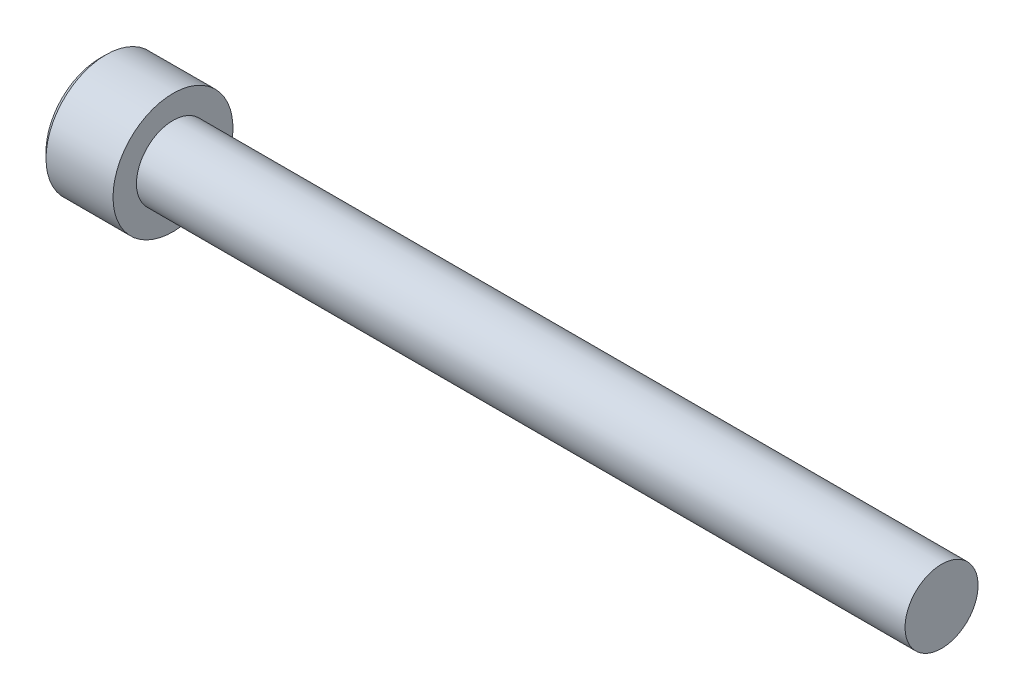
ISO-10303-21;
HEADER;
FILE_DESCRIPTION(('STEP AP214'),'2;1');
FILE_NAME('part.step','',(''),(''),'','','');
FILE_SCHEMA(('AUTOMOTIVE_DESIGN { 1 0 10303 214 1 1 1 1 }'));
ENDSEC;
DATA;
#1=APPLICATION_CONTEXT('core data for automotive mechanical design processes');
#2=APPLICATION_PROTOCOL_DEFINITION('international standard','automotive_design',2000,#1);
#3=PRODUCT_CONTEXT('',#1,'mechanical');
#4=PRODUCT('Part','Part','',(#3));
#5=PRODUCT_RELATED_PRODUCT_CATEGORY('part','',(#4));
#6=PRODUCT_DEFINITION_FORMATION('','',#4);
#7=PRODUCT_DEFINITION_CONTEXT('part definition',#1,'design');
#8=PRODUCT_DEFINITION('design','',#6,#7);
#9=PRODUCT_DEFINITION_SHAPE('','',#8);
#10=(LENGTH_UNIT() NAMED_UNIT(*) SI_UNIT(.MILLI.,.METRE.));
#11=(NAMED_UNIT(*) PLANE_ANGLE_UNIT() SI_UNIT($,.RADIAN.));
#12=(NAMED_UNIT(*) SI_UNIT($,.STERADIAN.) SOLID_ANGLE_UNIT());
#13=UNCERTAINTY_MEASURE_WITH_UNIT(LENGTH_MEASURE(1.E-05),#10,'distance_accuracy_value','');
#14=(GEOMETRIC_REPRESENTATION_CONTEXT(3) GLOBAL_UNCERTAINTY_ASSIGNED_CONTEXT((#13)) GLOBAL_UNIT_ASSIGNED_CONTEXT((#10,
#11,#12)) REPRESENTATION_CONTEXT('',''));
#15=CARTESIAN_POINT('',(0.,0.,0.));
#16=DIRECTION('',(0.,0.,1.));
#17=DIRECTION('',(1.,0.,0.));
#18=AXIS2_PLACEMENT_3D('',#15,#16,#17);
#19=CARTESIAN_POINT('',(-2.28600000000007,0.,0.));
#20=DIRECTION('',(-1.,0.,0.));
#21=DIRECTION('',(0.,0.,1.));
#22=AXIS2_PLACEMENT_3D('',#19,#20,#21);
#23=PLANE('',#22);
#24=DIRECTION('',(0.,0.5,0.866025403784439));
#25=VECTOR('',#24,1.);
#26=CARTESIAN_POINT('',(-2.28600000000007,2.29135888084633,0.));
#27=LINE('',#26,#25);
#28=CARTESIAN_POINT('',(-2.28600000000007,2.29135888084633,0.));
#29=VERTEX_POINT('',#28);
#30=CARTESIAN_POINT('',(-2.28600000000007,1.14567944042316,-1.984375));
#31=VERTEX_POINT('',#30);
#32=EDGE_CURVE('E72',#29,#31,#27,.F.);
#33=ORIENTED_EDGE('',*,*,#32,.T.);
#34=DIRECTION('',(0.,1.,0.));
#35=VECTOR('',#34,1.);
#36=CARTESIAN_POINT('',(-2.28600000000007,1.14567944042316,-1.984375));
#37=LINE('',#36,#35);
#38=CARTESIAN_POINT('',(-2.28600000000007,-1.14567944042316,-1.984375));
#39=VERTEX_POINT('',#38);
#40=EDGE_CURVE('E67',#31,#39,#37,.F.);
#41=ORIENTED_EDGE('',*,*,#40,.T.);
#42=DIRECTION('',(0.,0.5,-0.866025403784439));
#43=VECTOR('',#42,1.);
#44=CARTESIAN_POINT('',(-2.28600000000007,-1.14567944042316,-1.984375));
#45=LINE('',#44,#43);
#46=CARTESIAN_POINT('',(-2.28600000000007,-2.29135888084633,0.));
#47=VERTEX_POINT('',#46);
#48=EDGE_CURVE('E81',#39,#47,#45,.F.);
#49=ORIENTED_EDGE('',*,*,#48,.T.);
#50=DIRECTION('',(0.,-0.5,-0.866025403784439));
#51=VECTOR('',#50,1.);
#52=CARTESIAN_POINT('',(-2.28600000000007,-2.29135888084633,0.));
#53=LINE('',#52,#51);
#54=CARTESIAN_POINT('',(-2.28600000000007,-1.14567944042317,1.984375));
#55=VERTEX_POINT('',#54);
#56=EDGE_CURVE('E84',#47,#55,#53,.F.);
#57=ORIENTED_EDGE('',*,*,#56,.T.);
#58=DIRECTION('',(0.,1.,0.));
#59=VECTOR('',#58,1.);
#60=CARTESIAN_POINT('',(-2.28600000000007,-1.14567944042317,1.984375));
#61=LINE('',#60,#59);
#62=CARTESIAN_POINT('',(-2.28600000000007,1.14567944042317,1.984375));
#63=VERTEX_POINT('',#62);
#64=EDGE_CURVE('E94',#55,#63,#61,.T.);
#65=ORIENTED_EDGE('',*,*,#64,.T.);
#66=DIRECTION('',(0.,-0.5,0.866025403784439));
#67=VECTOR('',#66,1.);
#68=CARTESIAN_POINT('',(-2.28600000000007,1.14567944042316,1.984375));
#69=LINE('',#68,#67);
#70=EDGE_CURVE('E265',#63,#29,#69,.F.);
#71=ORIENTED_EDGE('',*,*,#70,.T.);
#72=EDGE_LOOP('',(#33,#41,#49,#57,#65,#71));
#73=FACE_BOUND('',#72,.T.);
#74=ADVANCED_FACE('F18',(#73),#23,.T.);
#75=CARTESIAN_POINT('',(-2.28600000000007,-1.14567944042316,-1.984375));
#76=DIRECTION('',(0.,-0.866025403784439,-0.5));
#77=DIRECTION('',(0.,0.5,-0.866025403784439));
#78=AXIS2_PLACEMENT_3D('',#75,#76,#77);
#79=PLANE('',#78);
#80=CARTESIAN_POINT('',(-4.82599999995871,-1.14567944040756,-1.98437500001887));
#81=CARTESIAN_POINT('',(-4.78666022792997,-1.18505700230148,-1.91617106214563));
#82=CARTESIAN_POINT('',(-4.74963132844072,-1.22509295783734,-1.8468267530301));
#83=CARTESIAN_POINT('',(-4.68183299424977,-1.30673037975396,-1.70542659047317));
#84=CARTESIAN_POINT('',(-4.65110127019237,-1.34833960561553,-1.63335729721673));
#85=CARTESIAN_POINT('',(-4.59845762010516,-1.432242568594,-1.48803310243203));
#86=CARTESIAN_POINT('',(-4.57641341195893,-1.47451494967301,-1.41481519064643));
#87=CARTESIAN_POINT('',(-4.54245011067441,-1.55999007976842,-1.26676792253773));
#88=CARTESIAN_POINT('',(-4.53050567471972,-1.6031902195197,-1.19194308559438));
#89=CARTESIAN_POINT('',(-4.51972842752365,-1.67764765054852,-1.06297903205139));
#90=CARTESIAN_POINT('',(-4.51813352794834,-1.70880881707173,-1.00900630841009));
#91=CARTESIAN_POINT('',(-4.52082392138599,-1.77108016542046,-0.901149169214274));
#92=CARTESIAN_POINT('',(-4.52511127545884,-1.80219032554946,-0.847264791239237));
#93=CARTESIAN_POINT('',(-4.53932219421538,-1.86411684097343,-0.740004920189235));
#94=CARTESIAN_POINT('',(-4.54925206045723,-1.8949328285454,-0.686630064029166));
#95=CARTESIAN_POINT('',(-4.5742029484467,-1.95603190279815,-0.580803363127978));
#96=CARTESIAN_POINT('',(-4.58922357974385,-1.98631503016081,-0.528351447923769));
#97=CARTESIAN_POINT('',(-4.63380478900425,-2.06386502548479,-0.394030915895904));
#98=CARTESIAN_POINT('',(-4.66672213384104,-2.11065153226583,-0.312994309042484));
#99=CARTESIAN_POINT('',(-4.72228952038986,-2.17944749410732,-0.193836207777459));
#100=CARTESIAN_POINT('',(-4.74181309375939,-2.20211890802843,-0.154568166986659));
#101=CARTESIAN_POINT('',(-4.78263970065987,-2.24704195201531,-0.0767591723707469));
#102=CARTESIAN_POINT('',(-4.80394164363173,-2.2692938292399,-0.0382177904539708));
#103=CARTESIAN_POINT('',(-4.82599999995675,-2.29135888085868,2.13931096265935E-11));
#104=B_SPLINE_CURVE_WITH_KNOTS('',3,(#80,#81,#82,#83,#84,#85,#86,#87,#88,#89,#90,#91,#92,#93,
#94,#95,#96,#97,#98,#99,#100,#101,#102,#103),.UNSPECIFIED.,.F.,.F.,(4,2,2,2,2,2,2,2,2,2,2,4),
(0.,0.264284909626495,0.530108996358094,0.791712695414128,1.05265800174404,1.23942150116703,
1.42625045663858,1.61328847394198,1.80031214908683,2.09727151182814,2.24534838946042,
2.39333511890876),.UNSPECIFIED.);
#105=CARTESIAN_POINT('',(-4.8259999999622,-1.14567944043207,-1.98437500001542));
#106=VERTEX_POINT('',#105);
#107=CARTESIAN_POINT('',(-4.82599999996846,-2.2913588808704,-2.00043543490866E-11));
#108=VERTEX_POINT('',#107);
#109=EDGE_CURVE('E21',#106,#108,#104,.T.);
#110=ORIENTED_EDGE('',*,*,#109,.T.);
#111=DIRECTION('',(1.,0.,0.));
#112=VECTOR('',#111,1.);
#113=CARTESIAN_POINT('',(-2.28600000000007,-2.29135888084633,0.));
#114=LINE('',#113,#112);
#115=EDGE_CURVE('E88',#108,#47,#114,.T.);
#116=ORIENTED_EDGE('',*,*,#115,.T.);
#117=ORIENTED_EDGE('',*,*,#48,.F.);
#118=DIRECTION('',(-1.,0.,0.));
#119=VECTOR('',#118,1.);
#120=CARTESIAN_POINT('',(-2.28600000000007,-1.14567944042316,-1.984375));
#121=LINE('',#120,#119);
#122=EDGE_CURVE('E59',#39,#106,#121,.T.);
#123=ORIENTED_EDGE('',*,*,#122,.T.);
#124=EDGE_LOOP('',(#110,#116,#117,#123));
#125=FACE_BOUND('',#124,.T.);
#126=ADVANCED_FACE('F89',(#125),#79,.F.);
#127=CARTESIAN_POINT('',(-2.28600000000007,-2.29135888084633,0.));
#128=DIRECTION('',(0.,-0.866025403784439,0.5));
#129=DIRECTION('',(0.,-0.5,-0.866025403784439));
#130=AXIS2_PLACEMENT_3D('',#127,#128,#129);
#131=PLANE('',#130);
#132=CARTESIAN_POINT('',(-4.8259999999587,-2.29135888085486,-2.29477011545215E-11));
#133=CARTESIAN_POINT('',(-4.78666022792997,-2.25198131896546,0.0682039378529055));
#134=CARTESIAN_POINT('',(-4.74963132844072,-2.21194536343147,0.137548246969503));
#135=CARTESIAN_POINT('',(-4.68183299424977,-2.13030794151622,0.278948409527231));
#136=CARTESIAN_POINT('',(-4.65110127019237,-2.08869871565414,0.351017702783381));
#137=CARTESIAN_POINT('',(-4.59845762010516,-2.00479575267531,0.49634189756787));
#138=CARTESIAN_POINT('',(-4.57641341195893,-1.96252337159644,0.569559809353542));
#139=CARTESIAN_POINT('',(-4.5424501106744,-1.87704824150112,0.717607077462301));
#140=CARTESIAN_POINT('',(-4.53050567471972,-1.8338481017498,0.792431914405622));
#141=CARTESIAN_POINT('',(-4.51972842752365,-1.75939067072096,0.921395967948603));
#142=CARTESIAN_POINT('',(-4.51813352794834,-1.72822950419776,0.975368691589913));
#143=CARTESIAN_POINT('',(-4.52082392138599,-1.66595815584903,1.08322583078573));
#144=CARTESIAN_POINT('',(-4.52511127545884,-1.63484799572003,1.13711020876076));
#145=CARTESIAN_POINT('',(-4.53932219421538,-1.57292148029607,1.24437007981077));
#146=CARTESIAN_POINT('',(-4.54925206045723,-1.54210549272409,1.29774493597083));
#147=CARTESIAN_POINT('',(-4.5742029484467,-1.48100641847134,1.40357163687202));
#148=CARTESIAN_POINT('',(-4.58922357974385,-1.45072329110868,1.45602355207623));
#149=CARTESIAN_POINT('',(-4.63380478900425,-1.3731732957847,1.5903440841041));
#150=CARTESIAN_POINT('',(-4.66672213384104,-1.32638678900366,1.67138069095752));
#151=CARTESIAN_POINT('',(-4.72228952038986,-1.25759082716218,1.79053879222254));
#152=CARTESIAN_POINT('',(-4.74181309375939,-1.23491941324106,1.82980683301334));
#153=CARTESIAN_POINT('',(-4.78263970065987,-1.18999636925419,1.90761582762925));
#154=CARTESIAN_POINT('',(-4.80394164363173,-1.1677444920296,1.94615720954603));
#155=CARTESIAN_POINT('',(-4.82599999995675,-1.14567944041081,1.98437500002139));
#156=B_SPLINE_CURVE_WITH_KNOTS('',3,(#132,#133,#134,#135,#136,#137,#138,#139,#140,#141,#142,
#143,#144,#145,#146,#147,#148,#149,#150,#151,#152,#153,#154,#155),.UNSPECIFIED.,.F.,.F.,(4,2,2,
2,2,2,2,2,2,2,2,4),(0.,0.264284909626495,0.530108996358093,0.791712695414127,1.05265800174404,
1.23942150116703,1.42625045663858,1.61328847394198,1.80031214908683,2.09727151182814,
2.24534838946042,2.39333511890876),.UNSPECIFIED.);
#157=CARTESIAN_POINT('',(-4.82599999996846,-1.14567944045252,1.98437500001084));
#158=VERTEX_POINT('',#157);
#159=EDGE_CURVE('E193',#108,#158,#156,.T.);
#160=ORIENTED_EDGE('',*,*,#159,.T.);
#161=DIRECTION('',(1.,0.,0.));
#162=VECTOR('',#161,1.);
#163=CARTESIAN_POINT('',(-2.28600000000007,-1.14567944042317,1.984375));
#164=LINE('',#163,#162);
#165=EDGE_CURVE('E98',#158,#55,#164,.T.);
#166=ORIENTED_EDGE('',*,*,#165,.T.);
#167=ORIENTED_EDGE('',*,*,#56,.F.);
#168=ORIENTED_EDGE('',*,*,#115,.F.);
#169=EDGE_LOOP('',(#160,#166,#167,#168));
#170=FACE_BOUND('',#169,.T.);
#171=ADVANCED_FACE('F96',(#170),#131,.F.);
#172=CARTESIAN_POINT('',(-2.28600000000007,-1.14567944042317,1.984375));
#173=DIRECTION('',(0.,0.,1.));
#174=DIRECTION('',(1.,0.,0.));
#175=AXIS2_PLACEMENT_3D('',#172,#173,#174);
#176=PLANE('',#175);
#177=ORIENTED_EDGE('',*,*,#165,.F.);
#178=CARTESIAN_POINT('',(-4.8259999999587,-1.14567944044731,1.98437499999592));
#179=CARTESIAN_POINT('',(-4.78691618362759,-1.06743880343337,1.98437499999852));
#180=CARTESIAN_POINT('',(-4.7501144768492,-0.987898318961585,1.9843749999996));
#181=CARTESIAN_POINT('',(-4.68265620500543,-0.825677042029378,1.9843750000004));
#182=CARTESIAN_POINT('',(-4.65204056061158,-0.742979382529768,1.98437500000011));
#183=CARTESIAN_POINT('',(-4.59917392283072,-0.575193959556404,1.98437499999988));
#184=CARTESIAN_POINT('',(-4.57689462080734,-0.49011535911761,1.98437499999994));
#185=CARTESIAN_POINT('',(-4.54259467221838,-0.318093091130319,1.98437500000006));
#186=CARTESIAN_POINT('',(-4.53054230228845,-0.231156054976752,1.98437500000012));
#187=CARTESIAN_POINT('',(-4.52249110263748,-0.119918521510987,1.98437499999997));
#188=CARTESIAN_POINT('',(-4.5211894755748,-0.095946844304627,1.98437499999992));
#189=CARTESIAN_POINT('',(-4.51945182629809,-0.0479845644411721,1.98437500000008));
#190=CARTESIAN_POINT('',(-4.51901533386212,-0.0239939791589256,1.98437500000028));
#191=CARTESIAN_POINT('',(-4.51901809008374,0.0602201717457216,1.98437500000061));
#192=CARTESIAN_POINT('',(-4.52177452299895,0.120461721905418,1.98437500000017));
#193=CARTESIAN_POINT('',(-4.53263655124937,0.240474970989155,1.98437499999983));
#194=CARTESIAN_POINT('',(-4.5407458774972,0.300246312758386,1.98437499999994));
#195=CARTESIAN_POINT('',(-4.57259622946933,0.478763752804253,1.98437500000012));
#196=CARTESIAN_POINT('',(-4.60385422611701,0.596208828937716,1.98437500000003));
#197=CARTESIAN_POINT('',(-4.66780003592242,0.785921487441385,1.98437499999998));
#198=CARTESIAN_POINT('',(-4.69623457768568,0.859734609867161,1.98437499999999));
#199=CARTESIAN_POINT('',(-4.75786140400834,1.00456595519332,1.98437500000001));
#200=CARTESIAN_POINT('',(-4.79100779300387,1.07560356657162,1.98437500000002));
#201=CARTESIAN_POINT('',(-4.82599999995679,1.14567944044795,1.984375));
#202=B_SPLINE_CURVE_WITH_KNOTS('',3,(#178,#179,#180,#181,#182,#183,#184,#185,#186,#187,#188,
#189,#190,#191,#192,#193,#194,#195,#196,#197,#198,#199,#200,#201),.UNSPECIFIED.,.F.,.F.,(4,2,2,
2,2,2,2,2,2,2,2,4),(0.,0.262559005207489,0.526801735838257,0.790138824405868,1.05265603861851,
1.12466619182165,1.19663719499109,1.37727026726594,1.55802937209457,1.92104085090406,
2.15819130092386,2.39317265078733),.UNSPECIFIED.);
#203=CARTESIAN_POINT('',(-4.82599999996846,1.14567944041787,1.98437500003084));
#204=VERTEX_POINT('',#203);
#205=EDGE_CURVE('E174',#158,#204,#202,.T.);
#206=ORIENTED_EDGE('',*,*,#205,.T.);
#207=DIRECTION('',(1.,0.,0.));
#208=VECTOR('',#207,1.);
#209=CARTESIAN_POINT('',(-2.28600000000007,1.14567944042316,1.984375));
#210=LINE('',#209,#208);
#211=EDGE_CURVE('E262',#204,#63,#210,.T.);
#212=ORIENTED_EDGE('',*,*,#211,.T.);
#213=ORIENTED_EDGE('',*,*,#64,.F.);
#214=EDGE_LOOP('',(#177,#206,#212,#213));
#215=FACE_BOUND('',#214,.T.);
#216=ADVANCED_FACE('F183',(#215),#176,.F.);
#217=CARTESIAN_POINT('',(-2.28600000000007,1.14567944042316,1.984375));
#218=DIRECTION('',(0.,0.866025403784439,0.5));
#219=DIRECTION('',(0.,-0.5,0.866025403784439));
#220=AXIS2_PLACEMENT_3D('',#217,#218,#219);
#221=PLANE('',#220);
#222=CARTESIAN_POINT('',(-4.8259999999587,1.14567944040756,1.98437500001887));
#223=CARTESIAN_POINT('',(-4.78666022792997,1.18505700230148,1.91617106214563));
#224=CARTESIAN_POINT('',(-4.74963132844072,1.22509295783734,1.8468267530301));
#225=CARTESIAN_POINT('',(-4.68183299424977,1.30673037975396,1.70542659047317));
#226=CARTESIAN_POINT('',(-4.65110127019237,1.34833960561553,1.63335729721672));
#227=CARTESIAN_POINT('',(-4.59845762010516,1.432242568594,1.48803310243203));
#228=CARTESIAN_POINT('',(-4.57641341195893,1.47451494967301,1.41481519064643));
#229=CARTESIAN_POINT('',(-4.5424501106744,1.55999007976842,1.26676792253773));
#230=CARTESIAN_POINT('',(-4.53050567471972,1.6031902195197,1.19194308559439));
#231=CARTESIAN_POINT('',(-4.51972842752365,1.67764765054852,1.06297903205139));
#232=CARTESIAN_POINT('',(-4.51813352794834,1.70880881707173,1.00900630841009));
#233=CARTESIAN_POINT('',(-4.52082392138599,1.77108016542046,0.901149169214275));
#234=CARTESIAN_POINT('',(-4.52511127545884,1.80219032554946,0.847264791239238));
#235=CARTESIAN_POINT('',(-4.53932219421538,1.86411684097342,0.740004920189235));
#236=CARTESIAN_POINT('',(-4.54925206045723,1.8949328285454,0.686630064029167));
#237=CARTESIAN_POINT('',(-4.5742029484467,1.95603190279815,0.580803363127978));
#238=CARTESIAN_POINT('',(-4.58922357974385,1.98631503016081,0.52835144792377));
#239=CARTESIAN_POINT('',(-4.63380478900425,2.06386502548479,0.394030915895905));
#240=CARTESIAN_POINT('',(-4.66672213384104,2.11065153226583,0.312994309042484));
#241=CARTESIAN_POINT('',(-4.72228952038986,2.17944749410732,0.19383620777746));
#242=CARTESIAN_POINT('',(-4.74181309375939,2.20211890802843,0.154568166986659));
#243=CARTESIAN_POINT('',(-4.78263970065987,2.2470419520153,0.0767591723707469));
#244=CARTESIAN_POINT('',(-4.80394164363173,2.2692938292399,0.0382177904539711));
#245=CARTESIAN_POINT('',(-4.82599999995675,2.29135888085868,-2.13927120621134E-11));
#246=B_SPLINE_CURVE_WITH_KNOTS('',3,(#222,#223,#224,#225,#226,#227,#228,#229,#230,#231,#232,
#233,#234,#235,#236,#237,#238,#239,#240,#241,#242,#243,#244,#245),.UNSPECIFIED.,.F.,.F.,(4,2,2,
2,2,2,2,2,2,2,2,4),(0.,0.264284909626494,0.530108996358092,0.791712695414125,1.05265800174404,
1.23942150116703,1.42625045663858,1.61328847394198,1.80031214908683,2.09727151182813,
2.24534838946042,2.39333511890876),.UNSPECIFIED.);
#247=CARTESIAN_POINT('',(-4.82599999996846,2.29135888087039,2.00042200943634E-11));
#248=VERTEX_POINT('',#247);
#249=EDGE_CURVE('E168',#204,#248,#246,.T.);
#250=ORIENTED_EDGE('',*,*,#249,.T.);
#251=DIRECTION('',(1.,0.,0.));
#252=VECTOR('',#251,1.);
#253=CARTESIAN_POINT('',(-2.28600000000007,2.29135888084633,0.));
#254=LINE('',#253,#252);
#255=EDGE_CURVE('E257',#248,#29,#254,.T.);
#256=ORIENTED_EDGE('',*,*,#255,.T.);
#257=ORIENTED_EDGE('',*,*,#70,.F.);
#258=ORIENTED_EDGE('',*,*,#211,.F.);
#259=EDGE_LOOP('',(#250,#256,#257,#258));
#260=FACE_BOUND('',#259,.T.);
#261=ADVANCED_FACE('F179',(#260),#221,.F.);
#262=CARTESIAN_POINT('',(-2.28600000000007,2.29135888084633,0.));
#263=DIRECTION('',(0.,0.866025403784439,-0.5));
#264=DIRECTION('',(0.,0.5,0.866025403784439));
#265=AXIS2_PLACEMENT_3D('',#262,#263,#264);
#266=PLANE('',#265);
#267=CARTESIAN_POINT('',(-4.82599999995871,2.29135888085486,2.29489280696874E-11));
#268=CARTESIAN_POINT('',(-4.78666022792997,2.25198131896547,-0.0682039378529039));
#269=CARTESIAN_POINT('',(-4.74963132844072,2.21194536343147,-0.137548246969502));
#270=CARTESIAN_POINT('',(-4.68183299424977,2.13030794151622,-0.278948409527229));
#271=CARTESIAN_POINT('',(-4.65110127019237,2.08869871565414,-0.351017702783379));
#272=CARTESIAN_POINT('',(-4.59845762010516,2.00479575267531,-0.496341897567869));
#273=CARTESIAN_POINT('',(-4.57641341195893,1.96252337159644,-0.569559809353541));
#274=CARTESIAN_POINT('',(-4.5424501106744,1.87704824150112,-0.7176070774623));
#275=CARTESIAN_POINT('',(-4.53050567471972,1.8338481017498,-0.792431914405622));
#276=CARTESIAN_POINT('',(-4.51972842752365,1.75939067072096,-0.921395967948603));
#277=CARTESIAN_POINT('',(-4.51813352794834,1.72822950419776,-0.975368691589912));
#278=CARTESIAN_POINT('',(-4.52082392138599,1.66595815584903,-1.08322583078573));
#279=CARTESIAN_POINT('',(-4.52511127545884,1.63484799572003,-1.13711020876076));
#280=CARTESIAN_POINT('',(-4.53932219421538,1.57292148029607,-1.24437007981077));
#281=CARTESIAN_POINT('',(-4.54925206045723,1.54210549272409,-1.29774493597083));
#282=CARTESIAN_POINT('',(-4.5742029484467,1.48100641847134,-1.40357163687202));
#283=CARTESIAN_POINT('',(-4.58922357974385,1.45072329110868,-1.45602355207623));
#284=CARTESIAN_POINT('',(-4.63380478900425,1.3731732957847,-1.5903440841041));
#285=CARTESIAN_POINT('',(-4.66672213384104,1.32638678900366,-1.67138069095752));
#286=CARTESIAN_POINT('',(-4.72228952038986,1.25759082716218,-1.79053879222254));
#287=CARTESIAN_POINT('',(-4.74181309375939,1.23491941324106,-1.82980683301334));
#288=CARTESIAN_POINT('',(-4.78263970065987,1.18999636925419,-1.90761582762925));
#289=CARTESIAN_POINT('',(-4.80394164363173,1.1677444920296,-1.94615720954603));
#290=CARTESIAN_POINT('',(-4.82599999995675,1.14567944041081,-1.98437500002139));
#291=B_SPLINE_CURVE_WITH_KNOTS('',3,(#267,#268,#269,#270,#271,#272,#273,#274,#275,#276,#277,
#278,#279,#280,#281,#282,#283,#284,#285,#286,#287,#288,#289,#290),.UNSPECIFIED.,.F.,.F.,(4,2,2,
2,2,2,2,2,2,2,2,4),(0.,0.264284909626495,0.530108996358093,0.791712695414127,1.05265800174404,
1.23942150116703,1.42625045663858,1.61328847394198,1.80031214908683,2.09727151182814,
2.24534838946042,2.39333511890876),.UNSPECIFIED.);
#292=CARTESIAN_POINT('',(-4.82599999996846,1.14567944045252,-1.98437500001084));
#293=VERTEX_POINT('',#292);
#294=EDGE_CURVE('E40',#248,#293,#291,.T.);
#295=ORIENTED_EDGE('',*,*,#294,.T.);
#296=DIRECTION('',(-1.,0.,0.));
#297=VECTOR('',#296,1.);
#298=CARTESIAN_POINT('',(-2.28600000000007,1.14567944042316,-1.984375));
#299=LINE('',#298,#297);
#300=EDGE_CURVE('E247',#293,#31,#299,.F.);
#301=ORIENTED_EDGE('',*,*,#300,.T.);
#302=ORIENTED_EDGE('',*,*,#32,.F.);
#303=ORIENTED_EDGE('',*,*,#255,.F.);
#304=EDGE_LOOP('',(#295,#301,#302,#303));
#305=FACE_BOUND('',#304,.T.);
#306=ADVANCED_FACE('F182',(#305),#266,.F.);
#307=CARTESIAN_POINT('',(-2.28600000000007,1.14567944042316,-1.984375));
#308=DIRECTION('',(0.,0.,-1.));
#309=DIRECTION('',(-1.,0.,0.));
#310=AXIS2_PLACEMENT_3D('',#307,#308,#309);
#311=PLANE('',#310);
#312=CARTESIAN_POINT('',(-4.8259999999587,1.14567944044731,-1.98437499999592));
#313=CARTESIAN_POINT('',(-4.78666022793094,1.06692431665146,-1.98437499999853));
#314=CARTESIAN_POINT('',(-4.74963132844318,0.986852405569011,-1.98437499999961));
#315=CARTESIAN_POINT('',(-4.6818329942566,0.823577561711963,-1.9843750000004));
#316=CARTESIAN_POINT('',(-4.65110127020207,0.740359109975722,-1.98437500000011));
#317=CARTESIAN_POINT('',(-4.59845762012233,0.572553183993917,-1.9843749999999));
#318=CARTESIAN_POINT('',(-4.57641341198063,0.488008421824127,-1.98437499999997));
#319=CARTESIAN_POINT('',(-4.54245011070673,0.317058161610178,-1.98437500000003));
#320=CARTESIAN_POINT('',(-4.53050567475816,0.230657882096267,-1.98437500000001));
#321=CARTESIAN_POINT('',(-4.51972842757294,0.0817430200124032,-1.984375));
#322=CARTESIAN_POINT('',(-4.51813352800283,0.0194206869508218,-1.984375));
#323=CARTESIAN_POINT('',(-4.52082392145254,-0.1051220097764,-1.984375));
#324=CARTESIAN_POINT('',(-4.52511127553227,-0.167342330049008,-1.984375));
#325=CARTESIAN_POINT('',(-4.53932219430377,-0.291195360925477,-1.984375));
#326=CARTESIAN_POINT('',(-4.54925206055372,-0.352827336083362,-1.984375));
#327=CARTESIAN_POINT('',(-4.57420294856008,-0.475025484616114,-1.984375));
#328=CARTESIAN_POINT('',(-4.58922357986604,-0.535591739354747,-1.984375));
#329=CARTESIAN_POINT('',(-4.63380478912724,-0.690691729958653,-1.984375));
#330=CARTESIAN_POINT('',(-4.66672213394715,-0.784264743465576,-1.984375));
#331=CARTESIAN_POINT('',(-4.7222895204619,-0.921856667069616,-1.984375));
#332=CARTESIAN_POINT('',(-4.74181309381856,-0.967199494886089,-1.984375));
#333=CARTESIAN_POINT('',(-4.78263970069104,-1.05704558280959,-1.984375));
#334=CARTESIAN_POINT('',(-4.80394164364776,-1.10154933723428,-1.984375));
#335=CARTESIAN_POINT('',(-4.82599999995675,-1.14567944044787,-1.984375));
#336=B_SPLINE_CURVE_WITH_KNOTS('',3,(#312,#313,#314,#315,#316,#317,#318,#319,#320,#321,#322,
#323,#324,#325,#326,#327,#328,#329,#330,#331,#332,#333,#334,#335),.UNSPECIFIED.,.F.,.F.,(4,2,2,
2,2,2,2,2,2,2,2,4),(0.,0.264284909658836,0.530108996422784,0.791712695509868,1.0526580018708,
1.23942150133878,1.42625045685537,1.61328847420389,1.80031214939384,2.09727151196384,
2.24534838950992,2.39333511887245),.UNSPECIFIED.);
#337=EDGE_CURVE('E133',#293,#106,#336,.T.);
#338=ORIENTED_EDGE('',*,*,#337,.T.);
#339=ORIENTED_EDGE('',*,*,#122,.F.);
#340=ORIENTED_EDGE('',*,*,#40,.F.);
#341=ORIENTED_EDGE('',*,*,#300,.F.);
#342=EDGE_LOOP('',(#338,#339,#340,#341));
#343=FACE_BOUND('',#342,.T.);
#344=ADVANCED_FACE('F146',(#343),#311,.F.);
#345=CARTESIAN_POINT('',(-4.82599999998001,0.,0.));
#346=DIRECTION('',(-1.,0.,0.));
#347=DIRECTION('',(0.,0.,1.));
#348=AXIS2_PLACEMENT_3D('',#345,#346,#347);
#349=CONICAL_SURFACE('',#348,2.29135888088194,0.785398163397448);
#350=ORIENTED_EDGE('',*,*,#109,.F.);
#351=CARTESIAN_POINT('',(-4.82599999998001,0.,0.));
#352=DIRECTION('',(-1.,0.,0.));
#353=DIRECTION('',(0.,0.,1.));
#354=AXIS2_PLACEMENT_3D('',#351,#352,#353);
#355=CIRCLE('',#354,2.29135888088194);
#356=EDGE_CURVE('E131',#106,#108,#355,.T.);
#357=ORIENTED_EDGE('',*,*,#356,.T.);
#358=EDGE_LOOP('',(#350,#357));
#359=FACE_BOUND('',#358,.T.);
#360=ADVANCED_FACE('F200',(#359),#349,.F.);
#361=CARTESIAN_POINT('',(-4.82599999998001,0.,0.));
#362=DIRECTION('',(-1.,0.,0.));
#363=DIRECTION('',(0.,0.,1.));
#364=AXIS2_PLACEMENT_3D('',#361,#362,#363);
#365=CONICAL_SURFACE('',#364,2.29135888088194,0.785398163397448);
#366=ORIENTED_EDGE('',*,*,#159,.F.);
#367=CARTESIAN_POINT('',(-4.82599999998001,0.,0.));
#368=DIRECTION('',(-1.,0.,0.));
#369=DIRECTION('',(0.,0.,1.));
#370=AXIS2_PLACEMENT_3D('',#367,#368,#369);
#371=CIRCLE('',#370,2.29135888088194);
#372=EDGE_CURVE('E128',#108,#158,#371,.T.);
#373=ORIENTED_EDGE('',*,*,#372,.T.);
#374=EDGE_LOOP('',(#366,#373));
#375=FACE_BOUND('',#374,.T.);
#376=ADVANCED_FACE('F197',(#375),#365,.F.);
#377=CARTESIAN_POINT('',(-4.82599999998001,0.,0.));
#378=DIRECTION('',(-1.,0.,0.));
#379=DIRECTION('',(0.,0.,1.));
#380=AXIS2_PLACEMENT_3D('',#377,#378,#379);
#381=CONICAL_SURFACE('',#380,2.29135888088194,0.78539816348948);
#382=ORIENTED_EDGE('',*,*,#205,.F.);
#383=CARTESIAN_POINT('',(-4.82599999998001,0.,0.));
#384=DIRECTION('',(-1.,0.,0.));
#385=DIRECTION('',(0.,0.,1.));
#386=AXIS2_PLACEMENT_3D('',#383,#384,#385);
#387=CIRCLE('',#386,2.29135888088194);
#388=EDGE_CURVE('E125',#158,#204,#387,.T.);
#389=ORIENTED_EDGE('',*,*,#388,.T.);
#390=EDGE_LOOP('',(#382,#389));
#391=FACE_BOUND('',#390,.T.);
#392=ADVANCED_FACE('F164',(#391),#381,.F.);
#393=CARTESIAN_POINT('',(-4.82599999998001,0.,0.));
#394=DIRECTION('',(-1.,0.,0.));
#395=DIRECTION('',(0.,0.,1.));
#396=AXIS2_PLACEMENT_3D('',#393,#394,#395);
#397=CONICAL_SURFACE('',#396,2.29135888088194,0.785398163397448);
#398=ORIENTED_EDGE('',*,*,#249,.F.);
#399=CARTESIAN_POINT('',(-4.82599999998001,0.,0.));
#400=DIRECTION('',(-1.,0.,0.));
#401=DIRECTION('',(0.,0.,1.));
#402=AXIS2_PLACEMENT_3D('',#399,#400,#401);
#403=CIRCLE('',#402,2.29135888088194);
#404=EDGE_CURVE('E122',#204,#248,#403,.T.);
#405=ORIENTED_EDGE('',*,*,#404,.T.);
#406=EDGE_LOOP('',(#398,#405));
#407=FACE_BOUND('',#406,.T.);
#408=ADVANCED_FACE('F159',(#407),#397,.F.);
#409=CARTESIAN_POINT('',(-4.82599999998001,0.,0.));
#410=DIRECTION('',(-1.,0.,0.));
#411=DIRECTION('',(0.,0.,1.));
#412=AXIS2_PLACEMENT_3D('',#409,#410,#411);
#413=CONICAL_SURFACE('',#412,2.29135888088194,0.785398163397448);
#414=ORIENTED_EDGE('',*,*,#294,.F.);
#415=CARTESIAN_POINT('',(-4.82599999998001,0.,0.));
#416=DIRECTION('',(-1.,0.,0.));
#417=DIRECTION('',(0.,0.,1.));
#418=AXIS2_PLACEMENT_3D('',#415,#416,#417);
#419=CIRCLE('',#418,2.29135888088194);
#420=EDGE_CURVE('E119',#248,#293,#419,.T.);
#421=ORIENTED_EDGE('',*,*,#420,.T.);
#422=EDGE_LOOP('',(#414,#421));
#423=FACE_BOUND('',#422,.T.);
#424=ADVANCED_FACE('F153',(#423),#413,.F.);
#425=CARTESIAN_POINT('',(-4.82599999998001,0.,0.));
#426=DIRECTION('',(-1.,0.,0.));
#427=DIRECTION('',(0.,0.,1.));
#428=AXIS2_PLACEMENT_3D('',#425,#426,#427);
#429=CONICAL_SURFACE('',#428,2.29135888088194,0.785398163489476);
#430=ORIENTED_EDGE('',*,*,#337,.F.);
#431=CARTESIAN_POINT('',(-4.82599999998001,0.,0.));
#432=DIRECTION('',(-1.,0.,0.));
#433=DIRECTION('',(0.,0.,1.));
#434=AXIS2_PLACEMENT_3D('',#431,#432,#433);
#435=CIRCLE('',#434,2.29135888088194);
#436=EDGE_CURVE('E116',#293,#106,#435,.T.);
#437=ORIENTED_EDGE('',*,*,#436,.T.);
#438=EDGE_LOOP('',(#430,#437));
#439=FACE_BOUND('',#438,.T.);
#440=ADVANCED_FACE('F148',(#439),#429,.F.);
#441=CARTESIAN_POINT('',(-4.82600000000007,0.,0.));
#442=DIRECTION('',(1.,0.,0.));
#443=DIRECTION('',(0.,0.,-1.));
#444=AXIS2_PLACEMENT_3D('',#441,#442,#443);
#445=PLANE('',#444);
#446=CARTESIAN_POINT('',(-4.82599999998001,0.,0.));
#447=DIRECTION('',(1.,0.,0.));
#448=DIRECTION('',(0.,0.,-1.));
#449=AXIS2_PLACEMENT_3D('',#446,#447,#448);
#450=CIRCLE('',#449,3.56615999999121);
#451=CARTESIAN_POINT('',(-4.82599999998001,0.,-3.56615999999121));
#452=VERTEX_POINT('',#451);
#453=EDGE_CURVE('E113',#452,#452,#450,.T.);
#454=ORIENTED_EDGE('',*,*,#453,.F.);
#455=EDGE_LOOP('',(#454));
#456=FACE_BOUND('',#455,.T.);
#457=ORIENTED_EDGE('',*,*,#420,.F.);
#458=ORIENTED_EDGE('',*,*,#404,.F.);
#459=ORIENTED_EDGE('',*,*,#388,.F.);
#460=ORIENTED_EDGE('',*,*,#372,.F.);
#461=ORIENTED_EDGE('',*,*,#356,.F.);
#462=ORIENTED_EDGE('',*,*,#436,.F.);
#463=EDGE_LOOP('',(#457,#458,#459,#460,#461,#462));
#464=FACE_BOUND('',#463,.T.);
#465=ADVANCED_FACE('F152',(#456,#464),#445,.F.);
#466=CARTESIAN_POINT('',(-4.42976000010731,0.,0.));
#467=DIRECTION('',(1.,0.,0.));
#468=DIRECTION('',(0.,0.,-1.));
#469=AXIS2_PLACEMENT_3D('',#466,#467,#468);
#470=CONICAL_SURFACE('',#469,3.96239999986392,0.785398163397448);
#471=CARTESIAN_POINT('',(-4.42976000000007,0.,0.));
#472=DIRECTION('',(-1.,0.,0.));
#473=DIRECTION('',(0.,0.,1.));
#474=AXIS2_PLACEMENT_3D('',#471,#472,#473);
#475=CIRCLE('',#474,3.9624);
#476=CARTESIAN_POINT('',(-4.42976000000007,0.,3.9624));
#477=VERTEX_POINT('',#476);
#478=EDGE_CURVE('E112',#477,#477,#475,.F.);
#479=ORIENTED_EDGE('',*,*,#478,.F.);
#480=EDGE_LOOP('',(#479));
#481=FACE_BOUND('',#480,.T.);
#482=ORIENTED_EDGE('',*,*,#453,.T.);
#483=EDGE_LOOP('',(#482));
#484=FACE_BOUND('',#483,.T.);
#485=ADVANCED_FACE('F228',(#481,#484),#470,.T.);
#486=CARTESIAN_POINT('',(-4.82600000000008,0.,0.));
#487=DIRECTION('',(-1.,0.,0.));
#488=DIRECTION('',(0.,0.,1.));
#489=AXIS2_PLACEMENT_3D('',#486,#487,#488);
#490=CYLINDRICAL_SURFACE('',#489,3.9624);
#491=ORIENTED_EDGE('',*,*,#478,.T.);
#492=EDGE_LOOP('',(#491));
#493=FACE_BOUND('',#492,.T.);
#494=CARTESIAN_POINT('',(0.,0.,0.));
#495=DIRECTION('',(-1.,0.,0.));
#496=DIRECTION('',(0.,0.,1.));
#497=AXIS2_PLACEMENT_3D('',#494,#495,#496);
#498=CIRCLE('',#497,3.9624);
#499=CARTESIAN_POINT('',(0.,0.,3.9624));
#500=VERTEX_POINT('',#499);
#501=EDGE_CURVE('E109',#500,#500,#498,.T.);
#502=ORIENTED_EDGE('',*,*,#501,.T.);
#503=EDGE_LOOP('',(#502));
#504=FACE_BOUND('',#503,.T.);
#505=ADVANCED_FACE('F225',(#493,#504),#490,.T.);
#506=CARTESIAN_POINT('',(50.8,0.,0.));
#507=DIRECTION('',(1.,0.,0.));
#508=DIRECTION('',(0.,0.,-1.));
#509=AXIS2_PLACEMENT_3D('',#506,#507,#508);
#510=PLANE('',#509);
#511=CARTESIAN_POINT('',(50.8,0.,0.));
#512=DIRECTION('',(-1.,0.,0.));
#513=DIRECTION('',(0.,0.,1.));
#514=AXIS2_PLACEMENT_3D('',#511,#512,#513);
#515=CIRCLE('',#514,2.413);
#516=CARTESIAN_POINT('',(50.8,0.,2.413));
#517=VERTEX_POINT('',#516);
#518=EDGE_CURVE('E31',#517,#517,#515,.T.);
#519=ORIENTED_EDGE('',*,*,#518,.F.);
#520=EDGE_LOOP('',(#519));
#521=FACE_BOUND('',#520,.T.);
#522=ADVANCED_FACE('F218',(#521),#510,.T.);
#523=CARTESIAN_POINT('',(0.,3.9624,0.));
#524=DIRECTION('',(-1.,0.,0.));
#525=DIRECTION('',(0.,0.,1.));
#526=AXIS2_PLACEMENT_3D('',#523,#524,#525);
#527=PLANE('',#526);
#528=CARTESIAN_POINT('',(0.,0.,0.));
#529=DIRECTION('',(-1.,0.,0.));
#530=DIRECTION('',(0.,0.,1.));
#531=AXIS2_PLACEMENT_3D('',#528,#529,#530);
#532=CIRCLE('',#531,2.413);
#533=CARTESIAN_POINT('',(0.,0.,2.413));
#534=VERTEX_POINT('',#533);
#535=EDGE_CURVE('E11',#534,#534,#532,.F.);
#536=ORIENTED_EDGE('',*,*,#535,.F.);
#537=EDGE_LOOP('',(#536));
#538=FACE_BOUND('',#537,.T.);
#539=ORIENTED_EDGE('',*,*,#501,.F.);
#540=EDGE_LOOP('',(#539));
#541=FACE_BOUND('',#540,.T.);
#542=ADVANCED_FACE('F212',(#538,#541),#527,.F.);
#543=CARTESIAN_POINT('',(50.8,0.,0.));
#544=DIRECTION('',(-1.,0.,0.));
#545=DIRECTION('',(0.,0.,1.));
#546=AXIS2_PLACEMENT_3D('',#543,#544,#545);
#547=CYLINDRICAL_SURFACE('',#546,2.413);
#548=ORIENTED_EDGE('',*,*,#535,.T.);
#549=EDGE_LOOP('',(#548));
#550=FACE_BOUND('',#549,.T.);
#551=ORIENTED_EDGE('',*,*,#518,.T.);
#552=EDGE_LOOP('',(#551));
#553=FACE_BOUND('',#552,.T.);
#554=ADVANCED_FACE('F210',(#550,#553),#547,.T.);
#555=CLOSED_SHELL('',(#74,#126,#171,#216,#261,#306,#344,#360,#376,#392,#408,#424,#440,#465,#485,
#505,#522,#542,#554));
#556=MANIFOLD_SOLID_BREP('B1',#555);
#557=ADVANCED_BREP_SHAPE_REPRESENTATION('',(#18,#556),#14);
#558=SHAPE_DEFINITION_REPRESENTATION(#9,#557);
ENDSEC;
END-ISO-10303-21;
